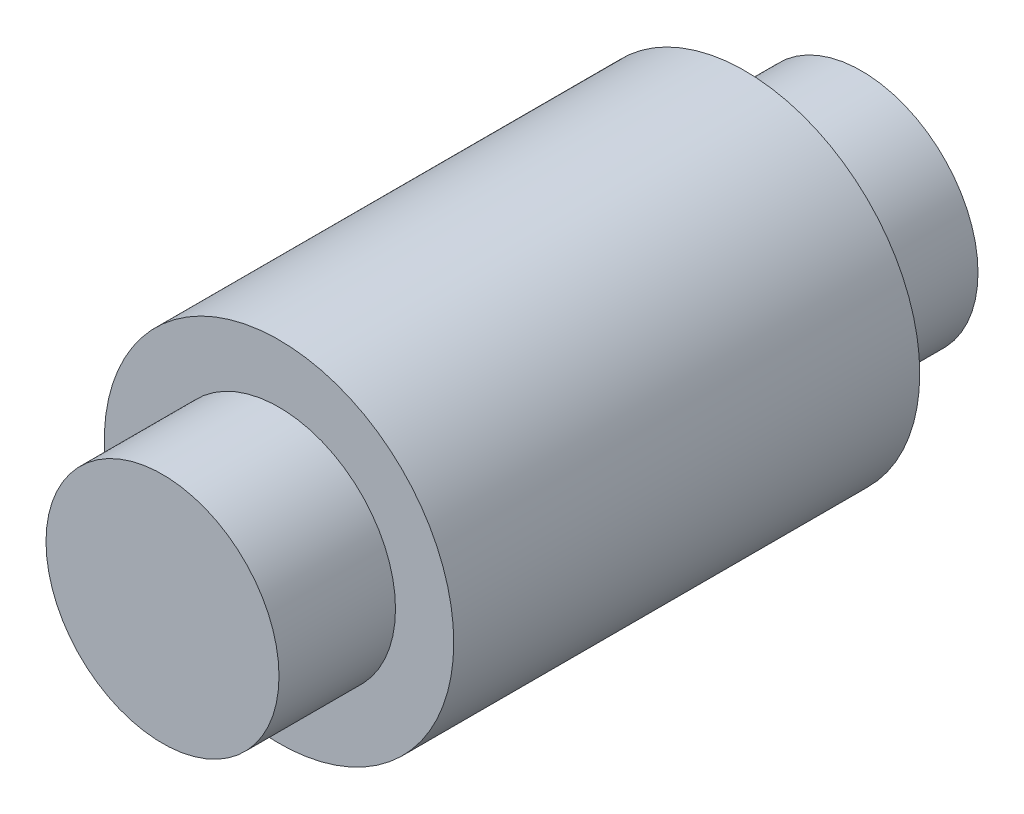
ISO-10303-21;
HEADER;
FILE_DESCRIPTION(('STEP AP214'),'2;1');
FILE_NAME('part.step','',(''),(''),'','','');
FILE_SCHEMA(('AUTOMOTIVE_DESIGN { 1 0 10303 214 1 1 1 1 }'));
ENDSEC;
DATA;
#1=APPLICATION_CONTEXT('core data for automotive mechanical design processes');
#2=APPLICATION_PROTOCOL_DEFINITION('international standard','automotive_design',2000,#1);
#3=PRODUCT_CONTEXT('',#1,'mechanical');
#4=PRODUCT('Part','Part','',(#3));
#5=PRODUCT_RELATED_PRODUCT_CATEGORY('part','',(#4));
#6=PRODUCT_DEFINITION_FORMATION('','',#4);
#7=PRODUCT_DEFINITION_CONTEXT('part definition',#1,'design');
#8=PRODUCT_DEFINITION('design','',#6,#7);
#9=PRODUCT_DEFINITION_SHAPE('','',#8);
#10=(LENGTH_UNIT() NAMED_UNIT(*) SI_UNIT(.MILLI.,.METRE.));
#11=(NAMED_UNIT(*) PLANE_ANGLE_UNIT() SI_UNIT($,.RADIAN.));
#12=(NAMED_UNIT(*) SI_UNIT($,.STERADIAN.) SOLID_ANGLE_UNIT());
#13=UNCERTAINTY_MEASURE_WITH_UNIT(LENGTH_MEASURE(1.E-05),#10,'distance_accuracy_value','');
#14=(GEOMETRIC_REPRESENTATION_CONTEXT(3) GLOBAL_UNCERTAINTY_ASSIGNED_CONTEXT((#13)) GLOBAL_UNIT_ASSIGNED_CONTEXT((#10,
#11,#12)) REPRESENTATION_CONTEXT('',''));
#15=CARTESIAN_POINT('',(0.,0.,0.));
#16=DIRECTION('',(0.,0.,1.));
#17=DIRECTION('',(1.,0.,0.));
#18=AXIS2_PLACEMENT_3D('',#15,#16,#17);
#19=CARTESIAN_POINT('',(0.,0.,10.));
#20=DIRECTION('',(0.,0.,-1.));
#21=DIRECTION('',(-1.,0.,0.));
#22=AXIS2_PLACEMENT_3D('',#19,#20,#21);
#23=CYLINDRICAL_SURFACE('',#22,7.5);
#24=CARTESIAN_POINT('',(0.,0.,10.));
#25=DIRECTION('',(0.,0.,1.));
#26=DIRECTION('',(1.,0.,0.));
#27=AXIS2_PLACEMENT_3D('',#24,#25,#26);
#28=CIRCLE('',#27,7.5);
#29=CARTESIAN_POINT('',(7.5,0.,10.));
#30=VERTEX_POINT('',#29);
#31=EDGE_CURVE('E48',#30,#30,#28,.T.);
#32=ORIENTED_EDGE('',*,*,#31,.F.);
#33=EDGE_LOOP('',(#32));
#34=FACE_BOUND('',#33,.T.);
#35=CARTESIAN_POINT('',(0.,0.,-10.));
#36=DIRECTION('',(0.,0.,1.));
#37=DIRECTION('',(1.,0.,0.));
#38=AXIS2_PLACEMENT_3D('',#35,#36,#37);
#39=CIRCLE('',#38,7.5);
#40=CARTESIAN_POINT('',(7.5,0.,-10.));
#41=VERTEX_POINT('',#40);
#42=EDGE_CURVE('E53',#41,#41,#39,.T.);
#43=ORIENTED_EDGE('',*,*,#42,.T.);
#44=EDGE_LOOP('',(#43));
#45=FACE_BOUND('',#44,.T.);
#46=ADVANCED_FACE('F41',(#34,#45),#23,.T.);
#47=CARTESIAN_POINT('',(0.,0.,10.));
#48=DIRECTION('',(0.,0.,1.));
#49=DIRECTION('',(1.,0.,0.));
#50=AXIS2_PLACEMENT_3D('',#47,#48,#49);
#51=PLANE('',#50);
#52=CARTESIAN_POINT('',(0.,0.,10.));
#53=DIRECTION('',(0.,0.,1.));
#54=DIRECTION('',(1.,0.,0.));
#55=AXIS2_PLACEMENT_3D('',#52,#53,#54);
#56=CIRCLE('',#55,5.);
#57=CARTESIAN_POINT('',(5.,0.,10.));
#58=VERTEX_POINT('',#57);
#59=EDGE_CURVE('E59',#58,#58,#56,.F.);
#60=ORIENTED_EDGE('',*,*,#59,.T.);
#61=EDGE_LOOP('',(#60));
#62=FACE_BOUND('',#61,.T.);
#63=ORIENTED_EDGE('',*,*,#31,.T.);
#64=EDGE_LOOP('',(#63));
#65=FACE_BOUND('',#64,.T.);
#66=ADVANCED_FACE('F91',(#62,#65),#51,.T.);
#67=CARTESIAN_POINT('',(0.,0.,-10.));
#68=DIRECTION('',(0.,0.,1.));
#69=DIRECTION('',(1.,0.,0.));
#70=AXIS2_PLACEMENT_3D('',#67,#68,#69);
#71=PLANE('',#70);
#72=CARTESIAN_POINT('',(0.,0.,-10.));
#73=DIRECTION('',(0.,0.,1.));
#74=DIRECTION('',(1.,0.,0.));
#75=AXIS2_PLACEMENT_3D('',#72,#73,#74);
#76=CIRCLE('',#75,5.);
#77=CARTESIAN_POINT('',(5.,0.,-10.));
#78=VERTEX_POINT('',#77);
#79=EDGE_CURVE('E10',#78,#78,#76,.F.);
#80=ORIENTED_EDGE('',*,*,#79,.F.);
#81=EDGE_LOOP('',(#80));
#82=FACE_BOUND('',#81,.T.);
#83=ORIENTED_EDGE('',*,*,#42,.F.);
#84=EDGE_LOOP('',(#83));
#85=FACE_BOUND('',#84,.T.);
#86=ADVANCED_FACE('F96',(#82,#85),#71,.F.);
#87=CARTESIAN_POINT('',(0.,0.,-15.));
#88=DIRECTION('',(0.,0.,1.));
#89=DIRECTION('',(1.,0.,0.));
#90=AXIS2_PLACEMENT_3D('',#87,#88,#89);
#91=PLANE('',#90);
#92=CARTESIAN_POINT('',(0.,0.,-15.));
#93=DIRECTION('',(0.,0.,1.));
#94=DIRECTION('',(1.,0.,0.));
#95=AXIS2_PLACEMENT_3D('',#92,#93,#94);
#96=CIRCLE('',#95,5.);
#97=CARTESIAN_POINT('',(5.,0.,-15.));
#98=VERTEX_POINT('',#97);
#99=EDGE_CURVE('E65',#98,#98,#96,.T.);
#100=ORIENTED_EDGE('',*,*,#99,.F.);
#101=EDGE_LOOP('',(#100));
#102=FACE_BOUND('',#101,.T.);
#103=ADVANCED_FACE('F85',(#102),#91,.F.);
#104=CARTESIAN_POINT('',(0.,0.,15.));
#105=DIRECTION('',(0.,0.,-1.));
#106=DIRECTION('',(-1.,0.,0.));
#107=AXIS2_PLACEMENT_3D('',#104,#105,#106);
#108=CYLINDRICAL_SURFACE('',#107,5.);
#109=ORIENTED_EDGE('',*,*,#99,.T.);
#110=EDGE_LOOP('',(#109));
#111=FACE_BOUND('',#110,.T.);
#112=ORIENTED_EDGE('',*,*,#79,.T.);
#113=EDGE_LOOP('',(#112));
#114=FACE_BOUND('',#113,.T.);
#115=ADVANCED_FACE('F77',(#111,#114),#108,.T.);
#116=ORIENTED_EDGE('',*,*,#59,.F.);
#117=EDGE_LOOP('',(#116));
#118=FACE_BOUND('',#117,.T.);
#119=CARTESIAN_POINT('',(0.,0.,15.));
#120=DIRECTION('',(0.,0.,1.));
#121=DIRECTION('',(1.,0.,0.));
#122=AXIS2_PLACEMENT_3D('',#119,#120,#121);
#123=CIRCLE('',#122,5.);
#124=CARTESIAN_POINT('',(5.,0.,15.));
#125=VERTEX_POINT('',#124);
#126=EDGE_CURVE('E64',#125,#125,#123,.T.);
#127=ORIENTED_EDGE('',*,*,#126,.F.);
#128=EDGE_LOOP('',(#127));
#129=FACE_BOUND('',#128,.T.);
#130=ADVANCED_FACE('F75',(#118,#129),#108,.T.);
#131=CARTESIAN_POINT('',(0.,0.,15.));
#132=DIRECTION('',(0.,0.,1.));
#133=DIRECTION('',(1.,0.,0.));
#134=AXIS2_PLACEMENT_3D('',#131,#132,#133);
#135=PLANE('',#134);
#136=ORIENTED_EDGE('',*,*,#126,.T.);
#137=EDGE_LOOP('',(#136));
#138=FACE_BOUND('',#137,.T.);
#139=ADVANCED_FACE('F73',(#138),#135,.T.);
#140=CLOSED_SHELL('',(#46,#66,#86,#103,#115,#130,#139));
#141=MANIFOLD_SOLID_BREP('B2',#140);
#142=ADVANCED_BREP_SHAPE_REPRESENTATION('',(#18,#141),#14);
#143=SHAPE_DEFINITION_REPRESENTATION(#9,#142);
ENDSEC;
END-ISO-10303-21;
